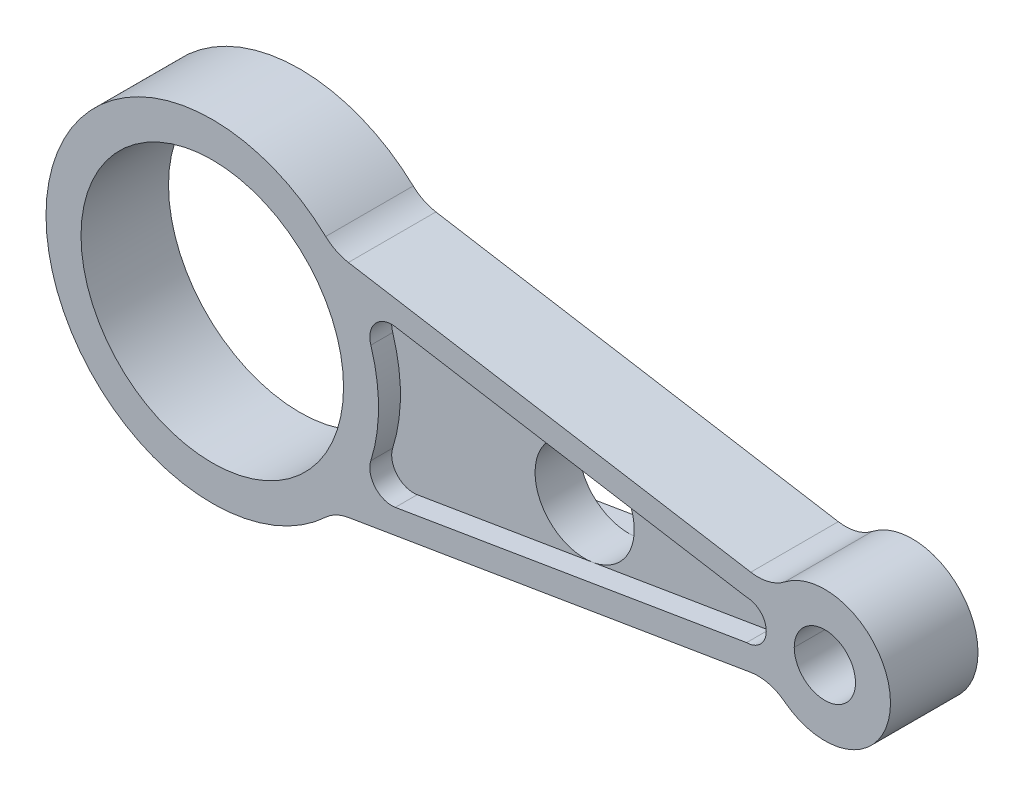
ISO-10303-21;
HEADER;
FILE_DESCRIPTION(('STEP AP214'),'2;1');
FILE_NAME('part.step','',(''),(''),'','','');
FILE_SCHEMA(('AUTOMOTIVE_DESIGN { 1 0 10303 214 1 1 1 1 }'));
ENDSEC;
DATA;
#1=APPLICATION_CONTEXT('core data for automotive mechanical design processes');
#2=APPLICATION_PROTOCOL_DEFINITION('international standard','automotive_design',2000,#1);
#3=PRODUCT_CONTEXT('',#1,'mechanical');
#4=PRODUCT('Part','Part','',(#3));
#5=PRODUCT_RELATED_PRODUCT_CATEGORY('part','',(#4));
#6=PRODUCT_DEFINITION_FORMATION('','',#4);
#7=PRODUCT_DEFINITION_CONTEXT('part definition',#1,'design');
#8=PRODUCT_DEFINITION('design','',#6,#7);
#9=PRODUCT_DEFINITION_SHAPE('','',#8);
#10=(LENGTH_UNIT() NAMED_UNIT(*) SI_UNIT(.MILLI.,.METRE.));
#11=(NAMED_UNIT(*) PLANE_ANGLE_UNIT() SI_UNIT($,.RADIAN.));
#12=(NAMED_UNIT(*) SI_UNIT($,.STERADIAN.) SOLID_ANGLE_UNIT());
#13=UNCERTAINTY_MEASURE_WITH_UNIT(LENGTH_MEASURE(1.E-05),#10,'distance_accuracy_value','');
#14=(GEOMETRIC_REPRESENTATION_CONTEXT(3) GLOBAL_UNCERTAINTY_ASSIGNED_CONTEXT((#13)) GLOBAL_UNIT_ASSIGNED_CONTEXT((#10,
#11,#12)) REPRESENTATION_CONTEXT('',''));
#15=CARTESIAN_POINT('',(0.,0.,0.));
#16=DIRECTION('',(0.,0.,1.));
#17=DIRECTION('',(1.,0.,0.));
#18=AXIS2_PLACEMENT_3D('',#15,#16,#17);
#19=CARTESIAN_POINT('',(41.0071259869049,12.9389187451698,5.));
#20=DIRECTION('',(0.,0.,1.));
#21=DIRECTION('',(1.,0.,0.));
#22=AXIS2_PLACEMENT_3D('',#19,#20,#21);
#23=PLANE('',#22);
#24=CARTESIAN_POINT('',(80.1069996900396,0.,5.));
#25=DIRECTION('',(0.,0.,1.));
#26=DIRECTION('',(1.,0.,0.));
#27=AXIS2_PLACEMENT_3D('',#24,#25,#26);
#28=CIRCLE('',#27,11.3395643366364);
#29=CARTESIAN_POINT('',(81.9699281167727,11.1854913625457,5.));
#30=VERTEX_POINT('',#29);
#31=CARTESIAN_POINT('',(81.9699281167727,-11.1854913625457,5.));
#32=VERTEX_POINT('',#31);
#33=EDGE_CURVE('E58',#30,#32,#28,.T.);
#34=ORIENTED_EDGE('',*,*,#33,.F.);
#35=DIRECTION('',(-0.986412795984335,0.164285714285714,0.));
#36=VECTOR('',#35,1.);
#37=CARTESIAN_POINT('',(41.8285545583335,17.8709827250915,5.));
#38=LINE('',#37,#36);
#39=CARTESIAN_POINT('',(41.8285545583335,17.8709827250915,5.));
#40=VERTEX_POINT('',#39);
#41=EDGE_CURVE('E285',#30,#40,#38,.T.);
#42=ORIENTED_EDGE('',*,*,#41,.T.);
#43=CARTESIAN_POINT('',(41.0071259869049,12.9389187451698,5.));
#44=DIRECTION('',(0.,0.,1.));
#45=DIRECTION('',(1.,0.,0.));
#46=AXIS2_PLACEMENT_3D('',#43,#44,#45);
#47=CIRCLE('',#46,5.);
#48=CARTESIAN_POINT('',(36.2388555233113,11.4343933096849,5.));
#49=VERTEX_POINT('',#48);
#50=EDGE_CURVE('E268',#40,#49,#47,.T.);
#51=ORIENTED_EDGE('',*,*,#50,.T.);
#52=CARTESIAN_POINT('',(0.,0.,5.));
#53=DIRECTION('',(0.,0.,-1.));
#54=DIRECTION('',(-1.,0.,0.));
#55=AXIS2_PLACEMENT_3D('',#52,#53,#54);
#56=CIRCLE('',#55,38.);
#57=CARTESIAN_POINT('',(36.2388555233114,-11.4343933096849,5.));
#58=VERTEX_POINT('',#57);
#59=EDGE_CURVE('E271',#49,#58,#56,.T.);
#60=ORIENTED_EDGE('',*,*,#59,.T.);
#61=CARTESIAN_POINT('',(41.0071259869049,-12.9389187451698,5.));
#62=DIRECTION('',(0.,0.,1.));
#63=DIRECTION('',(1.,0.,0.));
#64=AXIS2_PLACEMENT_3D('',#61,#62,#63);
#65=CIRCLE('',#64,4.99999999999998);
#66=CARTESIAN_POINT('',(41.8285545583335,-17.8709827250914,5.));
#67=VERTEX_POINT('',#66);
#68=EDGE_CURVE('E275',#58,#67,#65,.T.);
#69=ORIENTED_EDGE('',*,*,#68,.T.);
#70=DIRECTION('',(0.986412795984335,0.164285714285714,0.));
#71=VECTOR('',#70,1.);
#72=CARTESIAN_POINT('',(41.8285545583335,-17.8709827250914,5.));
#73=LINE('',#72,#71);
#74=EDGE_CURVE('E279',#67,#32,#73,.T.);
#75=ORIENTED_EDGE('',*,*,#74,.T.);
#76=EDGE_LOOP('',(#34,#42,#51,#60,#69,#75));
#77=FACE_BOUND('',#76,.T.);
#78=ADVANCED_FACE('F44',(#77),#23,.T.);
#79=CARTESIAN_POINT('',(41.0071259869049,12.9389187451698,-5.));
#80=DIRECTION('',(0.,0.,-1.));
#81=DIRECTION('',(1.,0.,0.));
#82=AXIS2_PLACEMENT_3D('',#79,#80,#81);
#83=PLANE('',#82);
#84=CARTESIAN_POINT('',(80.1069996900396,0.,-5.));
#85=DIRECTION('',(0.,0.,-1.));
#86=DIRECTION('',(-1.,0.,0.));
#87=AXIS2_PLACEMENT_3D('',#84,#85,#86);
#88=CIRCLE('',#87,11.3395643366364);
#89=CARTESIAN_POINT('',(81.9699281167727,11.1854913625457,-5.));
#90=VERTEX_POINT('',#89);
#91=CARTESIAN_POINT('',(81.9699281167727,-11.1854913625457,-5.));
#92=VERTEX_POINT('',#91);
#93=EDGE_CURVE('E11',#90,#92,#88,.T.);
#94=ORIENTED_EDGE('',*,*,#93,.F.);
#95=DIRECTION('',(-0.986412795984335,0.164285714285714,0.));
#96=VECTOR('',#95,1.);
#97=CARTESIAN_POINT('',(41.8285545583335,17.8709827250915,-5.));
#98=LINE('',#97,#96);
#99=CARTESIAN_POINT('',(122.111301675212,4.5,-5.));
#100=VERTEX_POINT('',#99);
#101=EDGE_CURVE('E211',#100,#90,#98,.T.);
#102=ORIENTED_EDGE('',*,*,#101,.F.);
#103=CARTESIAN_POINT('',(122.111301675212,0.,-5.));
#104=DIRECTION('',(0.,0.,1.));
#105=DIRECTION('',(1.,0.,0.));
#106=AXIS2_PLACEMENT_3D('',#103,#104,#105);
#107=CIRCLE('',#106,4.5);
#108=CARTESIAN_POINT('',(122.111301675212,-4.5,-5.));
#109=VERTEX_POINT('',#108);
#110=EDGE_CURVE('E227',#109,#100,#107,.T.);
#111=ORIENTED_EDGE('',*,*,#110,.F.);
#112=DIRECTION('',(0.986412795984335,0.164285714285714,0.));
#113=VECTOR('',#112,1.);
#114=CARTESIAN_POINT('',(41.8285545583335,-17.8709827250914,-5.));
#115=LINE('',#114,#113);
#116=EDGE_CURVE('E212',#92,#109,#115,.T.);
#117=ORIENTED_EDGE('',*,*,#116,.F.);
#118=EDGE_LOOP('',(#94,#102,#111,#117));
#119=FACE_BOUND('',#118,.T.);
#120=ADVANCED_FACE('F208',(#119),#83,.T.);
#121=CARTESIAN_POINT('',(140.,0.,10.));
#122=DIRECTION('',(0.,0.,-1.));
#123=DIRECTION('',(-1.,0.,0.));
#124=AXIS2_PLACEMENT_3D('',#121,#122,#123);
#125=CYLINDRICAL_SURFACE('',#124,7.00000000000001);
#126=CARTESIAN_POINT('',(140.,0.,10.));
#127=DIRECTION('',(0.,0.,1.));
#128=DIRECTION('',(1.,0.,0.));
#129=AXIS2_PLACEMENT_3D('',#126,#127,#128);
#130=CIRCLE('',#129,7.00000000000001);
#131=CARTESIAN_POINT('',(133.,0.,10.));
#132=VERTEX_POINT('',#131);
#133=CARTESIAN_POINT('',(147.,0.,10.));
#134=VERTEX_POINT('',#133);
#135=EDGE_CURVE('E318',#132,#134,#130,.T.);
#136=ORIENTED_EDGE('',*,*,#135,.T.);
#137=DIRECTION('',(0.,0.,-1.));
#138=VECTOR('',#137,1.);
#139=CARTESIAN_POINT('',(147.,0.,10.));
#140=LINE('',#139,#138);
#141=CARTESIAN_POINT('',(147.,0.,-10.));
#142=VERTEX_POINT('',#141);
#143=EDGE_CURVE('E205',#134,#142,#140,.T.);
#144=ORIENTED_EDGE('',*,*,#143,.T.);
#145=CARTESIAN_POINT('',(140.,0.,-10.));
#146=DIRECTION('',(0.,0.,1.));
#147=DIRECTION('',(1.,0.,0.));
#148=AXIS2_PLACEMENT_3D('',#145,#146,#147);
#149=CIRCLE('',#148,7.00000000000001);
#150=CARTESIAN_POINT('',(133.,0.,-10.));
#151=VERTEX_POINT('',#150);
#152=EDGE_CURVE('E323',#151,#142,#149,.T.);
#153=ORIENTED_EDGE('',*,*,#152,.F.);
#154=DIRECTION('',(0.,0.,1.));
#155=VECTOR('',#154,1.);
#156=CARTESIAN_POINT('',(133.,0.,10.));
#157=LINE('',#156,#155);
#158=EDGE_CURVE('E391',#151,#132,#157,.T.);
#159=ORIENTED_EDGE('',*,*,#158,.T.);
#160=EDGE_LOOP('',(#136,#144,#153,#159));
#161=FACE_BOUND('',#160,.T.);
#162=ADVANCED_FACE('F400',(#161),#125,.F.);
#163=CARTESIAN_POINT('',(140.,0.,-10.));
#164=DIRECTION('',(0.,0.,1.));
#165=DIRECTION('',(1.,0.,0.));
#166=AXIS2_PLACEMENT_3D('',#163,#164,#165);
#167=PLANE('',#166);
#168=ORIENTED_EDGE('',*,*,#152,.T.);
#169=EDGE_CURVE('E306',#142,#151,#149,.T.);
#170=ORIENTED_EDGE('',*,*,#169,.T.);
#171=EDGE_LOOP('',(#168,#170));
#172=FACE_BOUND('',#171,.T.);
#173=CARTESIAN_POINT('',(0.,0.,-10.));
#174=DIRECTION('',(0.,0.,1.));
#175=DIRECTION('',(1.,0.,0.));
#176=AXIS2_PLACEMENT_3D('',#173,#174,#175);
#177=CIRCLE('',#176,30.);
#178=CARTESIAN_POINT('',(30.,0.,-10.));
#179=VERTEX_POINT('',#178);
#180=EDGE_CURVE('E321',#179,#179,#177,.T.);
#181=ORIENTED_EDGE('',*,*,#180,.T.);
#182=EDGE_LOOP('',(#181));
#183=FACE_BOUND('',#182,.T.);
#184=CARTESIAN_POINT('',(140.,0.,-10.));
#185=DIRECTION('',(0.,0.,1.));
#186=DIRECTION('',(1.,0.,0.));
#187=AXIS2_PLACEMENT_3D('',#184,#185,#186);
#188=CIRCLE('',#187,15.);
#189=CARTESIAN_POINT('',(130.826967155943,-11.8682546501942,-10.));
#190=VERTEX_POINT('',#189);
#191=CARTESIAN_POINT('',(130.826967155943,11.8682546501942,-10.));
#192=VERTEX_POINT('',#191);
#193=EDGE_CURVE('E329',#190,#192,#188,.T.);
#194=ORIENTED_EDGE('',*,*,#193,.F.);
#195=CARTESIAN_POINT('',(124.711611926572,-19.7804244169904,-10.));
#196=DIRECTION('',(0.,0.,1.));
#197=DIRECTION('',(1.,0.,0.));
#198=AXIS2_PLACEMENT_3D('',#195,#196,#197);
#199=CIRCLE('',#198,10.);
#200=CARTESIAN_POINT('',(123.068754783715,-9.91629645714703,-10.));
#201=VERTEX_POINT('',#200);
#202=EDGE_CURVE('E383',#190,#201,#199,.T.);
#203=ORIENTED_EDGE('',*,*,#202,.T.);
#204=DIRECTION('',(0.986412795984335,0.164285714285714,0.));
#205=VECTOR('',#204,1.);
#206=CARTESIAN_POINT('',(27.9354736759495,-25.7606154914888,-10.));
#207=LINE('',#206,#205);
#208=CARTESIAN_POINT('',(31.1010604900549,-25.2333912979201,-10.));
#209=VERTEX_POINT('',#208);
#210=EDGE_CURVE('E336',#209,#201,#207,.T.);
#211=ORIENTED_EDGE('',*,*,#210,.F.);
#212=CARTESIAN_POINT('',(32.743917632912,-35.0975192577634,-10.));
#213=DIRECTION('',(0.,0.,1.));
#214=DIRECTION('',(1.,0.,0.));
#215=AXIS2_PLACEMENT_3D('',#212,#213,#214);
#216=CIRCLE('',#215,10.);
#217=CARTESIAN_POINT('',(25.9222681260553,-27.7855360790627,-10.));
#218=VERTEX_POINT('',#217);
#219=EDGE_CURVE('E364',#209,#218,#216,.T.);
#220=ORIENTED_EDGE('',*,*,#219,.T.);
#221=CARTESIAN_POINT('',(0.,0.,-10.));
#222=DIRECTION('',(0.,0.,1.));
#223=DIRECTION('',(1.,0.,0.));
#224=AXIS2_PLACEMENT_3D('',#221,#222,#223);
#225=CIRCLE('',#224,38.);
#226=CARTESIAN_POINT('',(25.9222681260553,27.7855360790627,-10.));
#227=VERTEX_POINT('',#226);
#228=EDGE_CURVE('E349',#227,#218,#225,.T.);
#229=ORIENTED_EDGE('',*,*,#228,.F.);
#230=CARTESIAN_POINT('',(32.743917632912,35.0975192577635,-10.));
#231=DIRECTION('',(0.,0.,1.));
#232=DIRECTION('',(1.,0.,0.));
#233=AXIS2_PLACEMENT_3D('',#230,#231,#232);
#234=CIRCLE('',#233,10.);
#235=CARTESIAN_POINT('',(31.1010604900548,25.2333912979201,-10.));
#236=VERTEX_POINT('',#235);
#237=EDGE_CURVE('E368',#227,#236,#234,.T.);
#238=ORIENTED_EDGE('',*,*,#237,.T.);
#239=DIRECTION('',(-0.986412795984335,0.164285714285714,0.));
#240=VECTOR('',#239,1.);
#241=CARTESIAN_POINT('',(128.063755469258,9.08438586269532,-10.));
#242=LINE('',#241,#240);
#243=CARTESIAN_POINT('',(123.068754783715,9.91629645714704,-10.));
#244=VERTEX_POINT('',#243);
#245=EDGE_CURVE('E347',#244,#236,#242,.T.);
#246=ORIENTED_EDGE('',*,*,#245,.F.);
#247=CARTESIAN_POINT('',(124.711611926572,19.7804244169904,-10.));
#248=DIRECTION('',(0.,0.,1.));
#249=DIRECTION('',(1.,0.,0.));
#250=AXIS2_PLACEMENT_3D('',#247,#248,#249);
#251=CIRCLE('',#250,10.);
#252=EDGE_CURVE('E387',#244,#192,#251,.T.);
#253=ORIENTED_EDGE('',*,*,#252,.T.);
#254=EDGE_LOOP('',(#194,#203,#211,#220,#229,#238,#246,#253));
#255=FACE_BOUND('',#254,.T.);
#256=CARTESIAN_POINT('',(41.0071259869049,12.9389187451698,-10.));
#257=DIRECTION('',(0.,0.,1.));
#258=DIRECTION('',(1.,0.,0.));
#259=AXIS2_PLACEMENT_3D('',#256,#257,#258);
#260=CIRCLE('',#259,5.);
#261=CARTESIAN_POINT('',(41.8285545583335,17.8709827250915,-10.));
#262=VERTEX_POINT('',#261);
#263=CARTESIAN_POINT('',(36.2388555233113,11.4343933096849,-10.));
#264=VERTEX_POINT('',#263);
#265=EDGE_CURVE('E239',#262,#264,#260,.T.);
#266=ORIENTED_EDGE('',*,*,#265,.T.);
#267=CARTESIAN_POINT('',(0.,0.,-10.));
#268=DIRECTION('',(0.,0.,-1.));
#269=DIRECTION('',(-1.,0.,0.));
#270=AXIS2_PLACEMENT_3D('',#267,#268,#269);
#271=CIRCLE('',#270,38.);
#272=CARTESIAN_POINT('',(36.2388555233114,-11.4343933096849,-10.));
#273=VERTEX_POINT('',#272);
#274=EDGE_CURVE('E252',#264,#273,#271,.T.);
#275=ORIENTED_EDGE('',*,*,#274,.T.);
#276=CARTESIAN_POINT('',(41.0071259869049,-12.9389187451698,-10.));
#277=DIRECTION('',(0.,0.,1.));
#278=DIRECTION('',(1.,0.,0.));
#279=AXIS2_PLACEMENT_3D('',#276,#277,#278);
#280=CIRCLE('',#279,4.99999999999998);
#281=CARTESIAN_POINT('',(41.8285545583335,-17.8709827250914,-10.));
#282=VERTEX_POINT('',#281);
#283=EDGE_CURVE('E249',#273,#282,#280,.T.);
#284=ORIENTED_EDGE('',*,*,#283,.T.);
#285=DIRECTION('',(0.986412795984335,0.164285714285714,0.));
#286=VECTOR('',#285,1.);
#287=CARTESIAN_POINT('',(41.8285545583335,-17.8709827250914,-10.));
#288=LINE('',#287,#286);
#289=CARTESIAN_POINT('',(122.111301675212,-4.5,-10.));
#290=VERTEX_POINT('',#289);
#291=EDGE_CURVE('E247',#282,#290,#288,.T.);
#292=ORIENTED_EDGE('',*,*,#291,.T.);
#293=CARTESIAN_POINT('',(122.111301675212,0.,-10.));
#294=DIRECTION('',(0.,0.,1.));
#295=DIRECTION('',(1.,0.,0.));
#296=AXIS2_PLACEMENT_3D('',#293,#294,#295);
#297=CIRCLE('',#296,4.5);
#298=CARTESIAN_POINT('',(122.111301675212,4.5,-10.));
#299=VERTEX_POINT('',#298);
#300=EDGE_CURVE('E244',#290,#299,#297,.T.);
#301=ORIENTED_EDGE('',*,*,#300,.T.);
#302=DIRECTION('',(-0.986412795984335,0.164285714285714,0.));
#303=VECTOR('',#302,1.);
#304=CARTESIAN_POINT('',(41.8285545583335,17.8709827250915,-10.));
#305=LINE('',#304,#303);
#306=EDGE_CURVE('E242',#299,#262,#305,.T.);
#307=ORIENTED_EDGE('',*,*,#306,.T.);
#308=EDGE_LOOP('',(#266,#275,#284,#292,#301,#307));
#309=FACE_BOUND('',#308,.T.);
#310=ADVANCED_FACE('F407',(#172,#183,#255,#309),#167,.F.);
#311=CARTESIAN_POINT('',(140.,0.,10.));
#312=DIRECTION('',(0.,0.,1.));
#313=DIRECTION('',(1.,0.,0.));
#314=AXIS2_PLACEMENT_3D('',#311,#312,#313);
#315=PLANE('',#314);
#316=ORIENTED_EDGE('',*,*,#135,.F.);
#317=EDGE_CURVE('E322',#134,#132,#130,.T.);
#318=ORIENTED_EDGE('',*,*,#317,.F.);
#319=EDGE_LOOP('',(#316,#318));
#320=FACE_BOUND('',#319,.T.);
#321=DIRECTION('',(0.986412795984335,0.164285714285714,0.));
#322=VECTOR('',#321,1.);
#323=CARTESIAN_POINT('',(27.9354736759495,-25.7606154914888,10.));
#324=LINE('',#323,#322);
#325=CARTESIAN_POINT('',(31.1010604900549,-25.2333912979201,10.));
#326=VERTEX_POINT('',#325);
#327=CARTESIAN_POINT('',(123.068754783715,-9.91629645714703,10.));
#328=VERTEX_POINT('',#327);
#329=EDGE_CURVE('E341',#326,#328,#324,.T.);
#330=ORIENTED_EDGE('',*,*,#329,.T.);
#331=CARTESIAN_POINT('',(124.711611926572,-19.7804244169904,10.));
#332=DIRECTION('',(0.,0.,1.));
#333=DIRECTION('',(1.,0.,0.));
#334=AXIS2_PLACEMENT_3D('',#331,#332,#333);
#335=CIRCLE('',#334,10.);
#336=CARTESIAN_POINT('',(130.826967155943,-11.8682546501942,10.));
#337=VERTEX_POINT('',#336);
#338=EDGE_CURVE('E385',#328,#337,#335,.F.);
#339=ORIENTED_EDGE('',*,*,#338,.T.);
#340=CARTESIAN_POINT('',(140.,0.,10.));
#341=DIRECTION('',(0.,0.,1.));
#342=DIRECTION('',(1.,0.,0.));
#343=AXIS2_PLACEMENT_3D('',#340,#341,#342);
#344=CIRCLE('',#343,15.);
#345=CARTESIAN_POINT('',(130.826967155943,11.8682546501942,10.));
#346=VERTEX_POINT('',#345);
#347=EDGE_CURVE('E332',#337,#346,#344,.T.);
#348=ORIENTED_EDGE('',*,*,#347,.T.);
#349=CARTESIAN_POINT('',(124.711611926572,19.7804244169904,10.));
#350=DIRECTION('',(0.,0.,1.));
#351=DIRECTION('',(1.,0.,0.));
#352=AXIS2_PLACEMENT_3D('',#349,#350,#351);
#353=CIRCLE('',#352,10.);
#354=CARTESIAN_POINT('',(123.068754783715,9.91629645714704,10.));
#355=VERTEX_POINT('',#354);
#356=EDGE_CURVE('E389',#346,#355,#353,.F.);
#357=ORIENTED_EDGE('',*,*,#356,.T.);
#358=DIRECTION('',(-0.986412795984335,0.164285714285714,0.));
#359=VECTOR('',#358,1.);
#360=CARTESIAN_POINT('',(128.063755469258,9.08438586269532,10.));
#361=LINE('',#360,#359);
#362=CARTESIAN_POINT('',(31.1010604900548,25.2333912979201,10.));
#363=VERTEX_POINT('',#362);
#364=EDGE_CURVE('E335',#355,#363,#361,.T.);
#365=ORIENTED_EDGE('',*,*,#364,.T.);
#366=CARTESIAN_POINT('',(32.743917632912,35.0975192577635,10.));
#367=DIRECTION('',(0.,0.,1.));
#368=DIRECTION('',(1.,0.,0.));
#369=AXIS2_PLACEMENT_3D('',#366,#367,#368);
#370=CIRCLE('',#369,10.);
#371=CARTESIAN_POINT('',(25.9222681260553,27.7855360790627,10.));
#372=VERTEX_POINT('',#371);
#373=EDGE_CURVE('E371',#363,#372,#370,.F.);
#374=ORIENTED_EDGE('',*,*,#373,.T.);
#375=CARTESIAN_POINT('',(0.,0.,10.));
#376=DIRECTION('',(0.,0.,1.));
#377=DIRECTION('',(1.,0.,0.));
#378=AXIS2_PLACEMENT_3D('',#375,#376,#377);
#379=CIRCLE('',#378,38.);
#380=CARTESIAN_POINT('',(25.9222681260553,-27.7855360790627,10.));
#381=VERTEX_POINT('',#380);
#382=EDGE_CURVE('E338',#372,#381,#379,.T.);
#383=ORIENTED_EDGE('',*,*,#382,.T.);
#384=CARTESIAN_POINT('',(32.743917632912,-35.0975192577634,10.));
#385=DIRECTION('',(0.,0.,1.));
#386=DIRECTION('',(1.,0.,0.));
#387=AXIS2_PLACEMENT_3D('',#384,#385,#386);
#388=CIRCLE('',#387,10.);
#389=EDGE_CURVE('E366',#381,#326,#388,.F.);
#390=ORIENTED_EDGE('',*,*,#389,.T.);
#391=EDGE_LOOP('',(#330,#339,#348,#357,#365,#374,#383,#390));
#392=FACE_BOUND('',#391,.T.);
#393=CARTESIAN_POINT('',(0.,0.,10.));
#394=DIRECTION('',(0.,0.,1.));
#395=DIRECTION('',(1.,0.,0.));
#396=AXIS2_PLACEMENT_3D('',#393,#394,#395);
#397=CIRCLE('',#396,30.);
#398=CARTESIAN_POINT('',(30.,0.,10.));
#399=VERTEX_POINT('',#398);
#400=EDGE_CURVE('E326',#399,#399,#397,.T.);
#401=ORIENTED_EDGE('',*,*,#400,.F.);
#402=EDGE_LOOP('',(#401));
#403=FACE_BOUND('',#402,.T.);
#404=CARTESIAN_POINT('',(41.0071259869049,12.9389187451698,10.));
#405=DIRECTION('',(0.,0.,1.));
#406=DIRECTION('',(1.,0.,0.));
#407=AXIS2_PLACEMENT_3D('',#404,#405,#406);
#408=CIRCLE('',#407,5.);
#409=CARTESIAN_POINT('',(41.8285545583335,17.8709827250915,10.));
#410=VERTEX_POINT('',#409);
#411=CARTESIAN_POINT('',(36.2388555233113,11.4343933096849,10.));
#412=VERTEX_POINT('',#411);
#413=EDGE_CURVE('E258',#410,#412,#408,.T.);
#414=ORIENTED_EDGE('',*,*,#413,.F.);
#415=DIRECTION('',(-0.986412795984335,0.164285714285714,0.));
#416=VECTOR('',#415,1.);
#417=CARTESIAN_POINT('',(41.8285545583335,17.8709827250915,10.));
#418=LINE('',#417,#416);
#419=CARTESIAN_POINT('',(122.111301675212,4.5,10.));
#420=VERTEX_POINT('',#419);
#421=EDGE_CURVE('E272',#420,#410,#418,.T.);
#422=ORIENTED_EDGE('',*,*,#421,.F.);
#423=CARTESIAN_POINT('',(122.111301675212,0.,10.));
#424=DIRECTION('',(0.,0.,1.));
#425=DIRECTION('',(1.,0.,0.));
#426=AXIS2_PLACEMENT_3D('',#423,#424,#425);
#427=CIRCLE('',#426,4.5);
#428=CARTESIAN_POINT('',(122.111301675212,-4.5,10.));
#429=VERTEX_POINT('',#428);
#430=EDGE_CURVE('E299',#429,#420,#427,.T.);
#431=ORIENTED_EDGE('',*,*,#430,.F.);
#432=DIRECTION('',(0.986412795984335,0.164285714285714,0.));
#433=VECTOR('',#432,1.);
#434=CARTESIAN_POINT('',(41.8285545583335,-17.8709827250914,10.));
#435=LINE('',#434,#433);
#436=CARTESIAN_POINT('',(41.8285545583335,-17.8709827250914,10.));
#437=VERTEX_POINT('',#436);
#438=EDGE_CURVE('E297',#437,#429,#435,.T.);
#439=ORIENTED_EDGE('',*,*,#438,.F.);
#440=CARTESIAN_POINT('',(41.0071259869049,-12.9389187451698,10.));
#441=DIRECTION('',(0.,0.,1.));
#442=DIRECTION('',(1.,0.,0.));
#443=AXIS2_PLACEMENT_3D('',#440,#441,#442);
#444=CIRCLE('',#443,4.99999999999998);
#445=CARTESIAN_POINT('',(36.2388555233114,-11.4343933096849,10.));
#446=VERTEX_POINT('',#445);
#447=EDGE_CURVE('E294',#446,#437,#444,.T.);
#448=ORIENTED_EDGE('',*,*,#447,.F.);
#449=CARTESIAN_POINT('',(0.,0.,10.));
#450=DIRECTION('',(0.,0.,-1.));
#451=DIRECTION('',(-1.,0.,0.));
#452=AXIS2_PLACEMENT_3D('',#449,#450,#451);
#453=CIRCLE('',#452,38.);
#454=EDGE_CURVE('E291',#412,#446,#453,.T.);
#455=ORIENTED_EDGE('',*,*,#454,.F.);
#456=EDGE_LOOP('',(#414,#422,#431,#439,#448,#455));
#457=FACE_BOUND('',#456,.T.);
#458=ADVANCED_FACE('F410',(#320,#392,#403,#457),#315,.T.);
#459=CARTESIAN_POINT('',(140.,0.,10.));
#460=DIRECTION('',(0.,0.,-1.));
#461=DIRECTION('',(-1.,0.,0.));
#462=AXIS2_PLACEMENT_3D('',#459,#460,#461);
#463=CYLINDRICAL_SURFACE('',#462,15.);
#464=ORIENTED_EDGE('',*,*,#347,.F.);
#465=DIRECTION('',(0.,0.,-1.));
#466=VECTOR('',#465,1.);
#467=CARTESIAN_POINT('',(130.826967155943,-11.8682546501942,10.));
#468=LINE('',#467,#466);
#469=EDGE_CURVE('E375',#337,#190,#468,.T.);
#470=ORIENTED_EDGE('',*,*,#469,.T.);
#471=ORIENTED_EDGE('',*,*,#193,.T.);
#472=DIRECTION('',(0.,0.,-1.));
#473=VECTOR('',#472,1.);
#474=CARTESIAN_POINT('',(130.826967155943,11.8682546501942,10.));
#475=LINE('',#474,#473);
#476=EDGE_CURVE('E373',#192,#346,#475,.F.);
#477=ORIENTED_EDGE('',*,*,#476,.T.);
#478=EDGE_LOOP('',(#464,#470,#471,#477));
#479=FACE_BOUND('',#478,.T.);
#480=ADVANCED_FACE('F507',(#479),#463,.T.);
#481=CARTESIAN_POINT('',(128.063755469258,9.08438586269532,10.));
#482=DIRECTION('',(-0.164285714285714,-0.986412795984335,0.));
#483=DIRECTION('',(0.986412795984335,-0.164285714285714,0.));
#484=AXIS2_PLACEMENT_3D('',#481,#482,#483);
#485=PLANE('',#484);
#486=ORIENTED_EDGE('',*,*,#364,.F.);
#487=DIRECTION('',(0.,0.,1.));
#488=VECTOR('',#487,1.);
#489=CARTESIAN_POINT('',(123.068754783715,9.91629645714704,-10.));
#490=LINE('',#489,#488);
#491=EDGE_CURVE('E380',#355,#244,#490,.F.);
#492=ORIENTED_EDGE('',*,*,#491,.T.);
#493=ORIENTED_EDGE('',*,*,#245,.T.);
#494=DIRECTION('',(0.,0.,1.));
#495=VECTOR('',#494,1.);
#496=CARTESIAN_POINT('',(31.1010604900548,25.2333912979201,10.));
#497=LINE('',#496,#495);
#498=EDGE_CURVE('E361',#236,#363,#497,.T.);
#499=ORIENTED_EDGE('',*,*,#498,.T.);
#500=EDGE_LOOP('',(#486,#492,#493,#499));
#501=FACE_BOUND('',#500,.T.);
#502=ADVANCED_FACE('F516',(#501),#485,.F.);
#503=CARTESIAN_POINT('',(0.,0.,10.));
#504=DIRECTION('',(0.,0.,-1.));
#505=DIRECTION('',(-1.,0.,0.));
#506=AXIS2_PLACEMENT_3D('',#503,#504,#505);
#507=CYLINDRICAL_SURFACE('',#506,38.);
#508=ORIENTED_EDGE('',*,*,#228,.T.);
#509=DIRECTION('',(0.,0.,-1.));
#510=VECTOR('',#509,1.);
#511=CARTESIAN_POINT('',(25.9222681260553,-27.7855360790627,10.));
#512=LINE('',#511,#510);
#513=EDGE_CURVE('E359',#218,#381,#512,.F.);
#514=ORIENTED_EDGE('',*,*,#513,.T.);
#515=ORIENTED_EDGE('',*,*,#382,.F.);
#516=DIRECTION('',(0.,0.,-1.));
#517=VECTOR('',#516,1.);
#518=CARTESIAN_POINT('',(25.9222681260553,27.7855360790627,10.));
#519=LINE('',#518,#517);
#520=EDGE_CURVE('E356',#372,#227,#519,.T.);
#521=ORIENTED_EDGE('',*,*,#520,.T.);
#522=EDGE_LOOP('',(#508,#514,#515,#521));
#523=FACE_BOUND('',#522,.T.);
#524=ADVANCED_FACE('F512',(#523),#507,.T.);
#525=CARTESIAN_POINT('',(27.9354736759495,-25.7606154914888,10.));
#526=DIRECTION('',(-0.164285714285714,0.986412795984335,0.));
#527=DIRECTION('',(-0.986412795984335,-0.164285714285714,0.));
#528=AXIS2_PLACEMENT_3D('',#525,#526,#527);
#529=PLANE('',#528);
#530=ORIENTED_EDGE('',*,*,#210,.T.);
#531=DIRECTION('',(0.,0.,1.));
#532=VECTOR('',#531,1.);
#533=CARTESIAN_POINT('',(123.068754783715,-9.91629645714703,10.));
#534=LINE('',#533,#532);
#535=EDGE_CURVE('E378',#201,#328,#534,.T.);
#536=ORIENTED_EDGE('',*,*,#535,.T.);
#537=ORIENTED_EDGE('',*,*,#329,.F.);
#538=DIRECTION('',(0.,0.,1.));
#539=VECTOR('',#538,1.);
#540=CARTESIAN_POINT('',(31.1010604900549,-25.2333912979201,-10.));
#541=LINE('',#540,#539);
#542=EDGE_CURVE('E344',#326,#209,#541,.F.);
#543=ORIENTED_EDGE('',*,*,#542,.T.);
#544=EDGE_LOOP('',(#530,#536,#537,#543));
#545=FACE_BOUND('',#544,.T.);
#546=ADVANCED_FACE('F504',(#545),#529,.F.);
#547=CARTESIAN_POINT('',(0.,0.,10.));
#548=DIRECTION('',(0.,0.,-1.));
#549=DIRECTION('',(-1.,0.,0.));
#550=AXIS2_PLACEMENT_3D('',#547,#548,#549);
#551=CYLINDRICAL_SURFACE('',#550,30.);
#552=ORIENTED_EDGE('',*,*,#400,.T.);
#553=EDGE_LOOP('',(#552));
#554=FACE_BOUND('',#553,.T.);
#555=ORIENTED_EDGE('',*,*,#180,.F.);
#556=EDGE_LOOP('',(#555));
#557=FACE_BOUND('',#556,.T.);
#558=ADVANCED_FACE('F501',(#554,#557),#551,.F.);
#559=ORIENTED_EDGE('',*,*,#143,.F.);
#560=ORIENTED_EDGE('',*,*,#317,.T.);
#561=ORIENTED_EDGE('',*,*,#158,.F.);
#562=ORIENTED_EDGE('',*,*,#169,.F.);
#563=EDGE_LOOP('',(#559,#560,#561,#562));
#564=FACE_BOUND('',#563,.T.);
#565=ADVANCED_FACE('F405',(#564),#125,.F.);
#566=CARTESIAN_POINT('',(32.743917632912,-35.0975192577634,10.));
#567=DIRECTION('',(0.,0.,-1.));
#568=DIRECTION('',(-1.,0.,0.));
#569=AXIS2_PLACEMENT_3D('',#566,#567,#568);
#570=CYLINDRICAL_SURFACE('',#569,10.);
#571=ORIENTED_EDGE('',*,*,#389,.F.);
#572=ORIENTED_EDGE('',*,*,#513,.F.);
#573=ORIENTED_EDGE('',*,*,#219,.F.);
#574=ORIENTED_EDGE('',*,*,#542,.F.);
#575=EDGE_LOOP('',(#571,#572,#573,#574));
#576=FACE_BOUND('',#575,.T.);
#577=ADVANCED_FACE('F500',(#576),#570,.F.);
#578=CARTESIAN_POINT('',(32.743917632912,35.0975192577635,10.));
#579=DIRECTION('',(0.,0.,-1.));
#580=DIRECTION('',(-1.,0.,0.));
#581=AXIS2_PLACEMENT_3D('',#578,#579,#580);
#582=CYLINDRICAL_SURFACE('',#581,10.);
#583=ORIENTED_EDGE('',*,*,#373,.F.);
#584=ORIENTED_EDGE('',*,*,#498,.F.);
#585=ORIENTED_EDGE('',*,*,#237,.F.);
#586=ORIENTED_EDGE('',*,*,#520,.F.);
#587=EDGE_LOOP('',(#583,#584,#585,#586));
#588=FACE_BOUND('',#587,.T.);
#589=ADVANCED_FACE('F526',(#588),#582,.F.);
#590=CARTESIAN_POINT('',(124.711611926572,-19.7804244169904,10.));
#591=DIRECTION('',(0.,0.,-1.));
#592=DIRECTION('',(-1.,0.,0.));
#593=AXIS2_PLACEMENT_3D('',#590,#591,#592);
#594=CYLINDRICAL_SURFACE('',#593,10.);
#595=ORIENTED_EDGE('',*,*,#338,.F.);
#596=ORIENTED_EDGE('',*,*,#535,.F.);
#597=ORIENTED_EDGE('',*,*,#202,.F.);
#598=ORIENTED_EDGE('',*,*,#469,.F.);
#599=EDGE_LOOP('',(#595,#596,#597,#598));
#600=FACE_BOUND('',#599,.T.);
#601=ADVANCED_FACE('F494',(#600),#594,.F.);
#602=CARTESIAN_POINT('',(124.711611926572,19.7804244169904,10.));
#603=DIRECTION('',(0.,0.,-1.));
#604=DIRECTION('',(-1.,0.,0.));
#605=AXIS2_PLACEMENT_3D('',#602,#603,#604);
#606=CYLINDRICAL_SURFACE('',#605,10.);
#607=ORIENTED_EDGE('',*,*,#356,.F.);
#608=ORIENTED_EDGE('',*,*,#476,.F.);
#609=ORIENTED_EDGE('',*,*,#252,.F.);
#610=ORIENTED_EDGE('',*,*,#491,.F.);
#611=EDGE_LOOP('',(#607,#608,#609,#610));
#612=FACE_BOUND('',#611,.T.);
#613=ADVANCED_FACE('F46',(#612),#606,.F.);
#614=CARTESIAN_POINT('',(41.0071259869049,12.9389187451698,5.));
#615=DIRECTION('',(0.,0.,1.));
#616=DIRECTION('',(1.,0.,0.));
#617=AXIS2_PLACEMENT_3D('',#614,#615,#616);
#618=CYLINDRICAL_SURFACE('',#617,5.);
#619=ORIENTED_EDGE('',*,*,#413,.T.);
#620=DIRECTION('',(0.,0.,1.));
#621=VECTOR('',#620,1.);
#622=CARTESIAN_POINT('',(36.2388555233113,11.4343933096849,5.));
#623=LINE('',#622,#621);
#624=EDGE_CURVE('E289',#49,#412,#623,.T.);
#625=ORIENTED_EDGE('',*,*,#624,.F.);
#626=ORIENTED_EDGE('',*,*,#50,.F.);
#627=DIRECTION('',(0.,0.,1.));
#628=VECTOR('',#627,1.);
#629=CARTESIAN_POINT('',(41.8285545583335,17.8709827250915,5.));
#630=LINE('',#629,#628);
#631=EDGE_CURVE('E303',#40,#410,#630,.T.);
#632=ORIENTED_EDGE('',*,*,#631,.T.);
#633=EDGE_LOOP('',(#619,#625,#626,#632));
#634=FACE_BOUND('',#633,.T.);
#635=ADVANCED_FACE('F487',(#634),#618,.F.);
#636=CARTESIAN_POINT('',(41.8285545583335,17.8709827250915,5.));
#637=DIRECTION('',(0.164285714285714,0.986412795984335,0.));
#638=DIRECTION('',(-0.986412795984335,0.164285714285714,0.));
#639=AXIS2_PLACEMENT_3D('',#636,#637,#638);
#640=PLANE('',#639);
#641=ORIENTED_EDGE('',*,*,#41,.F.);
#642=CARTESIAN_POINT('',(122.111301675212,4.5,5.));
#643=VERTEX_POINT('',#642);
#644=EDGE_CURVE('E286',#643,#30,#38,.T.);
#645=ORIENTED_EDGE('',*,*,#644,.F.);
#646=DIRECTION('',(0.,0.,1.));
#647=VECTOR('',#646,1.);
#648=CARTESIAN_POINT('',(122.111301675212,4.5,5.));
#649=LINE('',#648,#647);
#650=EDGE_CURVE('E307',#643,#420,#649,.T.);
#651=ORIENTED_EDGE('',*,*,#650,.T.);
#652=ORIENTED_EDGE('',*,*,#421,.T.);
#653=ORIENTED_EDGE('',*,*,#631,.F.);
#654=EDGE_LOOP('',(#641,#645,#651,#652,#653));
#655=FACE_BOUND('',#654,.T.);
#656=ADVANCED_FACE('F484',(#655),#640,.F.);
#657=CARTESIAN_POINT('',(122.111301675212,0.,5.));
#658=DIRECTION('',(0.,0.,1.));
#659=DIRECTION('',(1.,0.,0.));
#660=AXIS2_PLACEMENT_3D('',#657,#658,#659);
#661=CYLINDRICAL_SURFACE('',#660,4.5);
#662=ORIENTED_EDGE('',*,*,#430,.T.);
#663=ORIENTED_EDGE('',*,*,#650,.F.);
#664=CARTESIAN_POINT('',(122.111301675212,0.,5.));
#665=DIRECTION('',(0.,0.,1.));
#666=DIRECTION('',(1.,0.,0.));
#667=AXIS2_PLACEMENT_3D('',#664,#665,#666);
#668=CIRCLE('',#667,4.5);
#669=CARTESIAN_POINT('',(122.111301675212,-4.5,5.));
#670=VERTEX_POINT('',#669);
#671=EDGE_CURVE('E282',#670,#643,#668,.T.);
#672=ORIENTED_EDGE('',*,*,#671,.F.);
#673=DIRECTION('',(0.,0.,1.));
#674=VECTOR('',#673,1.);
#675=CARTESIAN_POINT('',(122.111301675212,-4.5,5.));
#676=LINE('',#675,#674);
#677=EDGE_CURVE('E309',#670,#429,#676,.T.);
#678=ORIENTED_EDGE('',*,*,#677,.T.);
#679=EDGE_LOOP('',(#662,#663,#672,#678));
#680=FACE_BOUND('',#679,.T.);
#681=ADVANCED_FACE('F478',(#680),#661,.F.);
#682=CARTESIAN_POINT('',(41.8285545583335,-17.8709827250914,5.));
#683=DIRECTION('',(0.164285714285714,-0.986412795984335,0.));
#684=DIRECTION('',(0.986412795984335,0.164285714285714,0.));
#685=AXIS2_PLACEMENT_3D('',#682,#683,#684);
#686=PLANE('',#685);
#687=EDGE_CURVE('E278',#32,#670,#73,.T.);
#688=ORIENTED_EDGE('',*,*,#687,.F.);
#689=ORIENTED_EDGE('',*,*,#74,.F.);
#690=DIRECTION('',(0.,0.,1.));
#691=VECTOR('',#690,1.);
#692=CARTESIAN_POINT('',(41.8285545583335,-17.8709827250914,5.));
#693=LINE('',#692,#691);
#694=EDGE_CURVE('E312',#67,#437,#693,.T.);
#695=ORIENTED_EDGE('',*,*,#694,.T.);
#696=ORIENTED_EDGE('',*,*,#438,.T.);
#697=ORIENTED_EDGE('',*,*,#677,.F.);
#698=EDGE_LOOP('',(#688,#689,#695,#696,#697));
#699=FACE_BOUND('',#698,.T.);
#700=ADVANCED_FACE('F467',(#699),#686,.F.);
#701=CARTESIAN_POINT('',(41.0071259869049,-12.9389187451698,5.));
#702=DIRECTION('',(0.,0.,1.));
#703=DIRECTION('',(1.,0.,0.));
#704=AXIS2_PLACEMENT_3D('',#701,#702,#703);
#705=CYLINDRICAL_SURFACE('',#704,4.99999999999998);
#706=ORIENTED_EDGE('',*,*,#447,.T.);
#707=ORIENTED_EDGE('',*,*,#694,.F.);
#708=ORIENTED_EDGE('',*,*,#68,.F.);
#709=DIRECTION('',(0.,0.,1.));
#710=VECTOR('',#709,1.);
#711=CARTESIAN_POINT('',(36.2388555233114,-11.4343933096849,5.));
#712=LINE('',#711,#710);
#713=EDGE_CURVE('E314',#58,#446,#712,.T.);
#714=ORIENTED_EDGE('',*,*,#713,.T.);
#715=EDGE_LOOP('',(#706,#707,#708,#714));
#716=FACE_BOUND('',#715,.T.);
#717=ADVANCED_FACE('F458',(#716),#705,.F.);
#718=CARTESIAN_POINT('',(0.,0.,5.));
#719=DIRECTION('',(0.,0.,1.));
#720=DIRECTION('',(1.,0.,0.));
#721=AXIS2_PLACEMENT_3D('',#718,#719,#720);
#722=CYLINDRICAL_SURFACE('',#721,38.);
#723=ORIENTED_EDGE('',*,*,#454,.T.);
#724=ORIENTED_EDGE('',*,*,#713,.F.);
#725=ORIENTED_EDGE('',*,*,#59,.F.);
#726=ORIENTED_EDGE('',*,*,#624,.T.);
#727=EDGE_LOOP('',(#723,#724,#725,#726));
#728=FACE_BOUND('',#727,.T.);
#729=ADVANCED_FACE('F453',(#728),#722,.T.);
#730=EDGE_CURVE('E461',#32,#30,#28,.T.);
#731=ORIENTED_EDGE('',*,*,#730,.F.);
#732=ORIENTED_EDGE('',*,*,#687,.T.);
#733=ORIENTED_EDGE('',*,*,#671,.T.);
#734=ORIENTED_EDGE('',*,*,#644,.T.);
#735=EDGE_LOOP('',(#731,#732,#733,#734));
#736=FACE_BOUND('',#735,.T.);
#737=ADVANCED_FACE('F442',(#736),#23,.T.);
#738=CARTESIAN_POINT('',(41.0071259869049,12.9389187451698,-5.));
#739=DIRECTION('',(0.,0.,-1.));
#740=DIRECTION('',(-1.,0.,0.));
#741=AXIS2_PLACEMENT_3D('',#738,#739,#740);
#742=CYLINDRICAL_SURFACE('',#741,5.);
#743=ORIENTED_EDGE('',*,*,#265,.F.);
#744=DIRECTION('',(0.,0.,-1.));
#745=VECTOR('',#744,1.);
#746=CARTESIAN_POINT('',(41.8285545583335,17.8709827250915,-5.));
#747=LINE('',#746,#745);
#748=CARTESIAN_POINT('',(41.8285545583335,17.8709827250915,-5.));
#749=VERTEX_POINT('',#748);
#750=EDGE_CURVE('E238',#749,#262,#747,.T.);
#751=ORIENTED_EDGE('',*,*,#750,.F.);
#752=CARTESIAN_POINT('',(41.0071259869049,12.9389187451698,-5.));
#753=DIRECTION('',(0.,0.,1.));
#754=DIRECTION('',(1.,0.,0.));
#755=AXIS2_PLACEMENT_3D('',#752,#753,#754);
#756=CIRCLE('',#755,5.);
#757=CARTESIAN_POINT('',(36.2388555233113,11.4343933096849,-5.));
#758=VERTEX_POINT('',#757);
#759=EDGE_CURVE('E218',#749,#758,#756,.T.);
#760=ORIENTED_EDGE('',*,*,#759,.T.);
#761=DIRECTION('',(0.,0.,-1.));
#762=VECTOR('',#761,1.);
#763=CARTESIAN_POINT('',(36.2388555233113,11.4343933096849,-5.));
#764=LINE('',#763,#762);
#765=EDGE_CURVE('E255',#758,#264,#764,.T.);
#766=ORIENTED_EDGE('',*,*,#765,.T.);
#767=EDGE_LOOP('',(#743,#751,#760,#766));
#768=FACE_BOUND('',#767,.T.);
#769=ADVANCED_FACE('F418',(#768),#742,.F.);
#770=CARTESIAN_POINT('',(0.,0.,-5.));
#771=DIRECTION('',(0.,0.,-1.));
#772=DIRECTION('',(-1.,0.,0.));
#773=AXIS2_PLACEMENT_3D('',#770,#771,#772);
#774=CYLINDRICAL_SURFACE('',#773,38.);
#775=ORIENTED_EDGE('',*,*,#274,.F.);
#776=ORIENTED_EDGE('',*,*,#765,.F.);
#777=CARTESIAN_POINT('',(0.,0.,-5.));
#778=DIRECTION('',(0.,0.,-1.));
#779=DIRECTION('',(-1.,0.,0.));
#780=AXIS2_PLACEMENT_3D('',#777,#778,#779);
#781=CIRCLE('',#780,38.);
#782=CARTESIAN_POINT('',(36.2388555233114,-11.4343933096849,-5.));
#783=VERTEX_POINT('',#782);
#784=EDGE_CURVE('E236',#758,#783,#781,.T.);
#785=ORIENTED_EDGE('',*,*,#784,.T.);
#786=DIRECTION('',(0.,0.,-1.));
#787=VECTOR('',#786,1.);
#788=CARTESIAN_POINT('',(36.2388555233114,-11.4343933096849,-5.));
#789=LINE('',#788,#787);
#790=EDGE_CURVE('E259',#783,#273,#789,.T.);
#791=ORIENTED_EDGE('',*,*,#790,.T.);
#792=EDGE_LOOP('',(#775,#776,#785,#791));
#793=FACE_BOUND('',#792,.T.);
#794=ADVANCED_FACE('F434',(#793),#774,.T.);
#795=CARTESIAN_POINT('',(41.0071259869049,-12.9389187451698,-5.));
#796=DIRECTION('',(0.,0.,-1.));
#797=DIRECTION('',(-1.,0.,0.));
#798=AXIS2_PLACEMENT_3D('',#795,#796,#797);
#799=CYLINDRICAL_SURFACE('',#798,4.99999999999998);
#800=ORIENTED_EDGE('',*,*,#283,.F.);
#801=ORIENTED_EDGE('',*,*,#790,.F.);
#802=CARTESIAN_POINT('',(41.0071259869049,-12.9389187451698,-5.));
#803=DIRECTION('',(0.,0.,1.));
#804=DIRECTION('',(1.,0.,0.));
#805=AXIS2_PLACEMENT_3D('',#802,#803,#804);
#806=CIRCLE('',#805,4.99999999999998);
#807=CARTESIAN_POINT('',(41.8285545583335,-17.8709827250914,-5.));
#808=VERTEX_POINT('',#807);
#809=EDGE_CURVE('E234',#783,#808,#806,.T.);
#810=ORIENTED_EDGE('',*,*,#809,.T.);
#811=DIRECTION('',(0.,0.,-1.));
#812=VECTOR('',#811,1.);
#813=CARTESIAN_POINT('',(41.8285545583335,-17.8709827250914,-5.));
#814=LINE('',#813,#812);
#815=EDGE_CURVE('E261',#808,#282,#814,.T.);
#816=ORIENTED_EDGE('',*,*,#815,.T.);
#817=EDGE_LOOP('',(#800,#801,#810,#816));
#818=FACE_BOUND('',#817,.T.);
#819=ADVANCED_FACE('F432',(#818),#799,.F.);
#820=CARTESIAN_POINT('',(41.8285545583335,-17.8709827250914,-5.));
#821=DIRECTION('',(-0.164285714285714,0.986412795984335,0.));
#822=DIRECTION('',(-0.986412795984335,-0.164285714285714,0.));
#823=AXIS2_PLACEMENT_3D('',#820,#821,#822);
#824=PLANE('',#823);
#825=EDGE_CURVE('E232',#808,#92,#115,.T.);
#826=ORIENTED_EDGE('',*,*,#825,.T.);
#827=ORIENTED_EDGE('',*,*,#116,.T.);
#828=DIRECTION('',(0.,0.,-1.));
#829=VECTOR('',#828,1.);
#830=CARTESIAN_POINT('',(122.111301675212,-4.5,-5.));
#831=LINE('',#830,#829);
#832=EDGE_CURVE('E263',#109,#290,#831,.T.);
#833=ORIENTED_EDGE('',*,*,#832,.T.);
#834=ORIENTED_EDGE('',*,*,#291,.F.);
#835=ORIENTED_EDGE('',*,*,#815,.F.);
#836=EDGE_LOOP('',(#826,#827,#833,#834,#835));
#837=FACE_BOUND('',#836,.T.);
#838=ADVANCED_FACE('F426',(#837),#824,.T.);
#839=CARTESIAN_POINT('',(122.111301675212,0.,-5.));
#840=DIRECTION('',(0.,0.,-1.));
#841=DIRECTION('',(-1.,0.,0.));
#842=AXIS2_PLACEMENT_3D('',#839,#840,#841);
#843=CYLINDRICAL_SURFACE('',#842,4.5);
#844=ORIENTED_EDGE('',*,*,#300,.F.);
#845=ORIENTED_EDGE('',*,*,#832,.F.);
#846=ORIENTED_EDGE('',*,*,#110,.T.);
#847=DIRECTION('',(0.,0.,-1.));
#848=VECTOR('',#847,1.);
#849=CARTESIAN_POINT('',(122.111301675212,4.5,-5.));
#850=LINE('',#849,#848);
#851=EDGE_CURVE('E226',#100,#299,#850,.T.);
#852=ORIENTED_EDGE('',*,*,#851,.T.);
#853=EDGE_LOOP('',(#844,#845,#846,#852));
#854=FACE_BOUND('',#853,.T.);
#855=ADVANCED_FACE('F424',(#854),#843,.F.);
#856=CARTESIAN_POINT('',(41.8285545583335,17.8709827250915,-5.));
#857=DIRECTION('',(-0.164285714285714,-0.986412795984335,0.));
#858=DIRECTION('',(0.986412795984335,-0.164285714285714,0.));
#859=AXIS2_PLACEMENT_3D('',#856,#857,#858);
#860=PLANE('',#859);
#861=ORIENTED_EDGE('',*,*,#101,.T.);
#862=EDGE_CURVE('E215',#90,#749,#98,.T.);
#863=ORIENTED_EDGE('',*,*,#862,.T.);
#864=ORIENTED_EDGE('',*,*,#750,.T.);
#865=ORIENTED_EDGE('',*,*,#306,.F.);
#866=ORIENTED_EDGE('',*,*,#851,.F.);
#867=EDGE_LOOP('',(#861,#863,#864,#865,#866));
#868=FACE_BOUND('',#867,.T.);
#869=ADVANCED_FACE('F224',(#868),#860,.T.);
#870=EDGE_CURVE('E48',#92,#90,#88,.T.);
#871=ORIENTED_EDGE('',*,*,#870,.F.);
#872=ORIENTED_EDGE('',*,*,#825,.F.);
#873=ORIENTED_EDGE('',*,*,#809,.F.);
#874=ORIENTED_EDGE('',*,*,#784,.F.);
#875=ORIENTED_EDGE('',*,*,#759,.F.);
#876=ORIENTED_EDGE('',*,*,#862,.F.);
#877=EDGE_LOOP('',(#871,#872,#873,#874,#875,#876));
#878=FACE_BOUND('',#877,.T.);
#879=ADVANCED_FACE('F216',(#878),#83,.T.);
#880=CARTESIAN_POINT('',(80.1069996900396,0.,-10.));
#881=DIRECTION('',(0.,0.,1.));
#882=DIRECTION('',(1.,0.,0.));
#883=AXIS2_PLACEMENT_3D('',#880,#881,#882);
#884=CYLINDRICAL_SURFACE('',#883,11.3395643366364);
#885=ORIENTED_EDGE('',*,*,#33,.T.);
#886=ORIENTED_EDGE('',*,*,#730,.T.);
#887=EDGE_LOOP('',(#885,#886));
#888=FACE_BOUND('',#887,.T.);
#889=ORIENTED_EDGE('',*,*,#93,.T.);
#890=ORIENTED_EDGE('',*,*,#870,.T.);
#891=EDGE_LOOP('',(#889,#890));
#892=FACE_BOUND('',#891,.T.);
#893=ADVANCED_FACE('F200',(#888,#892),#884,.F.);
#894=CLOSED_SHELL('',(#78,#120,#162,#310,#458,#480,#502,#524,#546,#558,#565,#577,#589,#601,#613,
#635,#656,#681,#700,#717,#729,#737,#769,#794,#819,#838,#855,#869,#879,#893));
#895=MANIFOLD_SOLID_BREP('B2',#894);
#896=ADVANCED_BREP_SHAPE_REPRESENTATION('',(#18,#895),#14);
#897=SHAPE_DEFINITION_REPRESENTATION(#9,#896);
ENDSEC;
END-ISO-10303-21;
